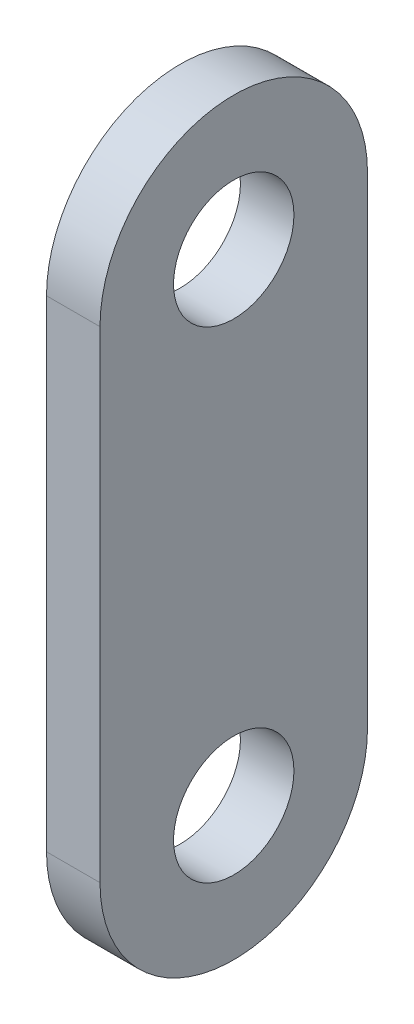
ISO-10303-21;
HEADER;
FILE_DESCRIPTION(('STEP AP214'),'2;1');
FILE_NAME('part.step','',(''),(''),'','','');
FILE_SCHEMA(('AUTOMOTIVE_DESIGN { 1 0 10303 214 1 1 1 1 }'));
ENDSEC;
DATA;
#1=APPLICATION_CONTEXT('core data for automotive mechanical design processes');
#2=APPLICATION_PROTOCOL_DEFINITION('international standard','automotive_design',2000,#1);
#3=PRODUCT_CONTEXT('',#1,'mechanical');
#4=PRODUCT('Part','Part','',(#3));
#5=PRODUCT_RELATED_PRODUCT_CATEGORY('part','',(#4));
#6=PRODUCT_DEFINITION_FORMATION('','',#4);
#7=PRODUCT_DEFINITION_CONTEXT('part definition',#1,'design');
#8=PRODUCT_DEFINITION('design','',#6,#7);
#9=PRODUCT_DEFINITION_SHAPE('','',#8);
#10=(LENGTH_UNIT() NAMED_UNIT(*) SI_UNIT(.MILLI.,.METRE.));
#11=(NAMED_UNIT(*) PLANE_ANGLE_UNIT() SI_UNIT($,.RADIAN.));
#12=(NAMED_UNIT(*) SI_UNIT($,.STERADIAN.) SOLID_ANGLE_UNIT());
#13=UNCERTAINTY_MEASURE_WITH_UNIT(LENGTH_MEASURE(1.E-05),#10,'distance_accuracy_value','');
#14=(GEOMETRIC_REPRESENTATION_CONTEXT(3) GLOBAL_UNCERTAINTY_ASSIGNED_CONTEXT((#13)) GLOBAL_UNIT_ASSIGNED_CONTEXT((#10,
#11,#12)) REPRESENTATION_CONTEXT('',''));
#15=CARTESIAN_POINT('',(0.,0.,0.));
#16=DIRECTION('',(0.,0.,1.));
#17=DIRECTION('',(1.,0.,0.));
#18=AXIS2_PLACEMENT_3D('',#15,#16,#17);
#19=CARTESIAN_POINT('',(3.175,-28.575,0.));
#20=DIRECTION('',(-1.,0.,0.));
#21=DIRECTION('',(0.,0.,1.));
#22=AXIS2_PLACEMENT_3D('',#19,#20,#21);
#23=CYLINDRICAL_SURFACE('',#22,15.875);
#24=CARTESIAN_POINT('',(-3.175,-28.575,0.));
#25=DIRECTION('',(1.,0.,0.));
#26=DIRECTION('',(0.,0.,-1.));
#27=AXIS2_PLACEMENT_3D('',#24,#25,#26);
#28=CIRCLE('',#27,15.875);
#29=CARTESIAN_POINT('',(-3.175,-28.575,15.875));
#30=VERTEX_POINT('',#29);
#31=CARTESIAN_POINT('',(-3.175,-28.575,-15.875));
#32=VERTEX_POINT('',#31);
#33=EDGE_CURVE('E96',#30,#32,#28,.T.);
#34=ORIENTED_EDGE('',*,*,#33,.T.);
#35=DIRECTION('',(-1.,0.,0.));
#36=VECTOR('',#35,1.);
#37=CARTESIAN_POINT('',(3.175,-28.575,-15.875));
#38=LINE('',#37,#36);
#39=CARTESIAN_POINT('',(3.175,-28.575,-15.875));
#40=VERTEX_POINT('',#39);
#41=EDGE_CURVE('E11',#40,#32,#38,.T.);
#42=ORIENTED_EDGE('',*,*,#41,.F.);
#43=CARTESIAN_POINT('',(3.175,-28.575,0.));
#44=DIRECTION('',(1.,0.,0.));
#45=DIRECTION('',(0.,0.,-1.));
#46=AXIS2_PLACEMENT_3D('',#43,#44,#45);
#47=CIRCLE('',#46,15.875);
#48=CARTESIAN_POINT('',(3.175,-28.575,15.875));
#49=VERTEX_POINT('',#48);
#50=EDGE_CURVE('E84',#49,#40,#47,.T.);
#51=ORIENTED_EDGE('',*,*,#50,.F.);
#52=DIRECTION('',(-1.,0.,0.));
#53=VECTOR('',#52,1.);
#54=CARTESIAN_POINT('',(3.175,-28.575,15.875));
#55=LINE('',#54,#53);
#56=EDGE_CURVE('E92',#49,#30,#55,.T.);
#57=ORIENTED_EDGE('',*,*,#56,.T.);
#58=EDGE_LOOP('',(#34,#42,#51,#57));
#59=FACE_BOUND('',#58,.T.);
#60=ADVANCED_FACE('F33',(#59),#23,.T.);
#61=CARTESIAN_POINT('',(3.175,-28.575,-15.875));
#62=DIRECTION('',(0.,0.,1.));
#63=DIRECTION('',(0.,-1.,0.));
#64=AXIS2_PLACEMENT_3D('',#61,#62,#63);
#65=PLANE('',#64);
#66=DIRECTION('',(0.,1.,0.));
#67=VECTOR('',#66,1.);
#68=CARTESIAN_POINT('',(-3.175,-28.575,-15.875));
#69=LINE('',#68,#67);
#70=CARTESIAN_POINT('',(-3.175,28.575,-15.875));
#71=VERTEX_POINT('',#70);
#72=EDGE_CURVE('E88',#32,#71,#69,.T.);
#73=ORIENTED_EDGE('',*,*,#72,.T.);
#74=DIRECTION('',(-1.,0.,0.));
#75=VECTOR('',#74,1.);
#76=CARTESIAN_POINT('',(3.175,28.575,-15.875));
#77=LINE('',#76,#75);
#78=CARTESIAN_POINT('',(3.175,28.575,-15.875));
#79=VERTEX_POINT('',#78);
#80=EDGE_CURVE('E41',#79,#71,#77,.T.);
#81=ORIENTED_EDGE('',*,*,#80,.F.);
#82=DIRECTION('',(0.,1.,0.));
#83=VECTOR('',#82,1.);
#84=CARTESIAN_POINT('',(3.175,-28.575,-15.875));
#85=LINE('',#84,#83);
#86=EDGE_CURVE('E79',#40,#79,#85,.T.);
#87=ORIENTED_EDGE('',*,*,#86,.F.);
#88=ORIENTED_EDGE('',*,*,#41,.T.);
#89=EDGE_LOOP('',(#73,#81,#87,#88));
#90=FACE_BOUND('',#89,.T.);
#91=ADVANCED_FACE('F87',(#90),#65,.F.);
#92=CARTESIAN_POINT('',(3.175,28.575,0.));
#93=DIRECTION('',(-1.,0.,0.));
#94=DIRECTION('',(0.,0.,1.));
#95=AXIS2_PLACEMENT_3D('',#92,#93,#94);
#96=CYLINDRICAL_SURFACE('',#95,15.875);
#97=CARTESIAN_POINT('',(-3.175,28.575,0.));
#98=DIRECTION('',(1.,0.,0.));
#99=DIRECTION('',(0.,0.,-1.));
#100=AXIS2_PLACEMENT_3D('',#97,#98,#99);
#101=CIRCLE('',#100,15.875);
#102=CARTESIAN_POINT('',(-3.175,28.575,15.875));
#103=VERTEX_POINT('',#102);
#104=EDGE_CURVE('E66',#71,#103,#101,.T.);
#105=ORIENTED_EDGE('',*,*,#104,.T.);
#106=DIRECTION('',(-1.,0.,0.));
#107=VECTOR('',#106,1.);
#108=CARTESIAN_POINT('',(3.175,28.575,15.875));
#109=LINE('',#108,#107);
#110=CARTESIAN_POINT('',(3.175,28.575,15.875));
#111=VERTEX_POINT('',#110);
#112=EDGE_CURVE('E89',#111,#103,#109,.T.);
#113=ORIENTED_EDGE('',*,*,#112,.F.);
#114=CARTESIAN_POINT('',(3.175,28.575,0.));
#115=DIRECTION('',(1.,0.,0.));
#116=DIRECTION('',(0.,0.,-1.));
#117=AXIS2_PLACEMENT_3D('',#114,#115,#116);
#118=CIRCLE('',#117,15.875);
#119=EDGE_CURVE('E82',#79,#111,#118,.T.);
#120=ORIENTED_EDGE('',*,*,#119,.F.);
#121=ORIENTED_EDGE('',*,*,#80,.T.);
#122=EDGE_LOOP('',(#105,#113,#120,#121));
#123=FACE_BOUND('',#122,.T.);
#124=ADVANCED_FACE('F90',(#123),#96,.T.);
#125=CARTESIAN_POINT('',(3.175,-28.575,15.875));
#126=DIRECTION('',(0.,0.,-1.));
#127=DIRECTION('',(0.,1.,0.));
#128=AXIS2_PLACEMENT_3D('',#125,#126,#127);
#129=PLANE('',#128);
#130=DIRECTION('',(0.,-1.,0.));
#131=VECTOR('',#130,1.);
#132=CARTESIAN_POINT('',(-3.175,-28.575,15.875));
#133=LINE('',#132,#131);
#134=EDGE_CURVE('E72',#103,#30,#133,.T.);
#135=ORIENTED_EDGE('',*,*,#134,.T.);
#136=ORIENTED_EDGE('',*,*,#56,.F.);
#137=DIRECTION('',(0.,-1.,0.));
#138=VECTOR('',#137,1.);
#139=CARTESIAN_POINT('',(3.175,-28.575,15.875));
#140=LINE('',#139,#138);
#141=EDGE_CURVE('E49',#111,#49,#140,.T.);
#142=ORIENTED_EDGE('',*,*,#141,.F.);
#143=ORIENTED_EDGE('',*,*,#112,.T.);
#144=EDGE_LOOP('',(#135,#136,#142,#143));
#145=FACE_BOUND('',#144,.T.);
#146=ADVANCED_FACE('F104',(#145),#129,.F.);
#147=CARTESIAN_POINT('',(3.175,-28.575,0.));
#148=DIRECTION('',(1.,0.,0.));
#149=DIRECTION('',(0.,0.,-1.));
#150=AXIS2_PLACEMENT_3D('',#147,#148,#149);
#151=PLANE('',#150);
#152=CARTESIAN_POINT('',(3.175,-28.575,0.));
#153=DIRECTION('',(1.,0.,0.));
#154=DIRECTION('',(0.,0.,-1.));
#155=AXIS2_PLACEMENT_3D('',#152,#153,#154);
#156=CIRCLE('',#155,7.14375);
#157=CARTESIAN_POINT('',(3.175,-28.575,-7.14375));
#158=VERTEX_POINT('',#157);
#159=EDGE_CURVE('E118',#158,#158,#156,.T.);
#160=ORIENTED_EDGE('',*,*,#159,.F.);
#161=EDGE_LOOP('',(#160));
#162=FACE_BOUND('',#161,.T.);
#163=CARTESIAN_POINT('',(3.175,28.575,0.));
#164=DIRECTION('',(1.,0.,0.));
#165=DIRECTION('',(0.,0.,-1.));
#166=AXIS2_PLACEMENT_3D('',#163,#164,#165);
#167=CIRCLE('',#166,7.14375);
#168=CARTESIAN_POINT('',(3.175,28.575,-7.14374999999999));
#169=VERTEX_POINT('',#168);
#170=EDGE_CURVE('E112',#169,#169,#167,.T.);
#171=ORIENTED_EDGE('',*,*,#170,.F.);
#172=EDGE_LOOP('',(#171));
#173=FACE_BOUND('',#172,.T.);
#174=ORIENTED_EDGE('',*,*,#50,.T.);
#175=ORIENTED_EDGE('',*,*,#86,.T.);
#176=ORIENTED_EDGE('',*,*,#119,.T.);
#177=ORIENTED_EDGE('',*,*,#141,.T.);
#178=EDGE_LOOP('',(#174,#175,#176,#177));
#179=FACE_BOUND('',#178,.T.);
#180=ADVANCED_FACE('F80',(#162,#173,#179),#151,.T.);
#181=CARTESIAN_POINT('',(-3.175,-28.575,0.));
#182=DIRECTION('',(1.,0.,0.));
#183=DIRECTION('',(0.,0.,-1.));
#184=AXIS2_PLACEMENT_3D('',#181,#182,#183);
#185=PLANE('',#184);
#186=CARTESIAN_POINT('',(-3.175,-28.575,0.));
#187=DIRECTION('',(1.,0.,0.));
#188=DIRECTION('',(0.,0.,-1.));
#189=AXIS2_PLACEMENT_3D('',#186,#187,#188);
#190=CIRCLE('',#189,7.14375);
#191=CARTESIAN_POINT('',(-3.175,-28.575,-7.14375));
#192=VERTEX_POINT('',#191);
#193=EDGE_CURVE('E115',#192,#192,#190,.F.);
#194=ORIENTED_EDGE('',*,*,#193,.F.);
#195=EDGE_LOOP('',(#194));
#196=FACE_BOUND('',#195,.T.);
#197=CARTESIAN_POINT('',(-3.175,28.575,0.));
#198=DIRECTION('',(1.,0.,0.));
#199=DIRECTION('',(0.,0.,-1.));
#200=AXIS2_PLACEMENT_3D('',#197,#198,#199);
#201=CIRCLE('',#200,7.14375);
#202=CARTESIAN_POINT('',(-3.175,28.575,-7.14374999999999));
#203=VERTEX_POINT('',#202);
#204=EDGE_CURVE('E99',#203,#203,#201,.F.);
#205=ORIENTED_EDGE('',*,*,#204,.F.);
#206=EDGE_LOOP('',(#205));
#207=FACE_BOUND('',#206,.T.);
#208=ORIENTED_EDGE('',*,*,#33,.F.);
#209=ORIENTED_EDGE('',*,*,#134,.F.);
#210=ORIENTED_EDGE('',*,*,#104,.F.);
#211=ORIENTED_EDGE('',*,*,#72,.F.);
#212=EDGE_LOOP('',(#208,#209,#210,#211));
#213=FACE_BOUND('',#212,.T.);
#214=ADVANCED_FACE('F107',(#196,#207,#213),#185,.F.);
#215=CARTESIAN_POINT('',(-3.176,28.575,0.));
#216=DIRECTION('',(1.,0.,0.));
#217=DIRECTION('',(0.,0.,-1.));
#218=AXIS2_PLACEMENT_3D('',#215,#216,#217);
#219=CYLINDRICAL_SURFACE('',#218,7.14375);
#220=ORIENTED_EDGE('',*,*,#170,.T.);
#221=EDGE_LOOP('',(#220));
#222=FACE_BOUND('',#221,.T.);
#223=ORIENTED_EDGE('',*,*,#204,.T.);
#224=EDGE_LOOP('',(#223));
#225=FACE_BOUND('',#224,.T.);
#226=ADVANCED_FACE('F130',(#222,#225),#219,.F.);
#227=CARTESIAN_POINT('',(-3.176,-28.575,0.));
#228=DIRECTION('',(1.,0.,0.));
#229=DIRECTION('',(0.,0.,-1.));
#230=AXIS2_PLACEMENT_3D('',#227,#228,#229);
#231=CYLINDRICAL_SURFACE('',#230,7.14375);
#232=ORIENTED_EDGE('',*,*,#159,.T.);
#233=EDGE_LOOP('',(#232));
#234=FACE_BOUND('',#233,.T.);
#235=ORIENTED_EDGE('',*,*,#193,.T.);
#236=EDGE_LOOP('',(#235));
#237=FACE_BOUND('',#236,.T.);
#238=ADVANCED_FACE('F122',(#234,#237),#231,.F.);
#239=CLOSED_SHELL('',(#60,#91,#124,#146,#180,#214,#226,#238));
#240=MANIFOLD_SOLID_BREP('B2',#239);
#241=ADVANCED_BREP_SHAPE_REPRESENTATION('',(#18,#240),#14);
#242=SHAPE_DEFINITION_REPRESENTATION(#9,#241);
ENDSEC;
END-ISO-10303-21;
